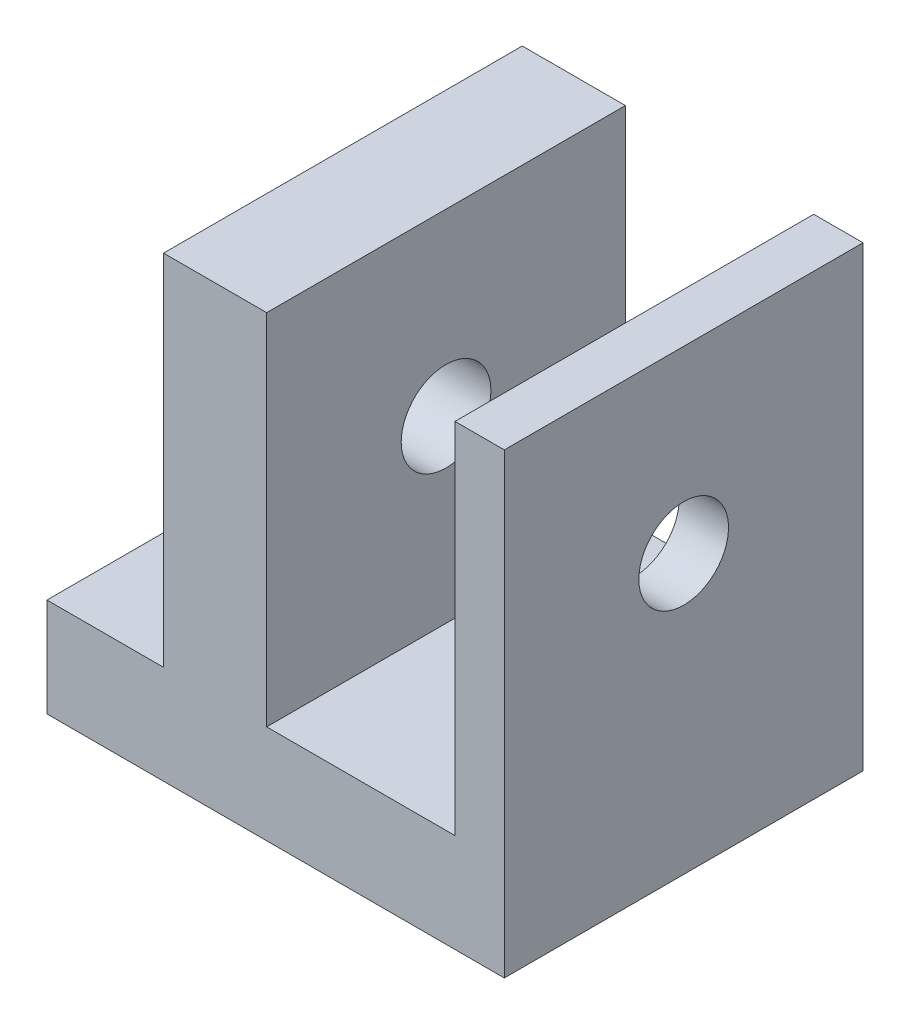
ISO-10303-21;
HEADER;
FILE_DESCRIPTION(('STEP AP214'),'2;1');
FILE_NAME('part.step','',(''),(''),'','','');
FILE_SCHEMA(('AUTOMOTIVE_DESIGN { 1 0 10303 214 1 1 1 1 }'));
ENDSEC;
DATA;
#1=APPLICATION_CONTEXT('core data for automotive mechanical design processes');
#2=APPLICATION_PROTOCOL_DEFINITION('international standard','automotive_design',2000,#1);
#3=PRODUCT_CONTEXT('',#1,'mechanical');
#4=PRODUCT('Part','Part','',(#3));
#5=PRODUCT_RELATED_PRODUCT_CATEGORY('part','',(#4));
#6=PRODUCT_DEFINITION_FORMATION('','',#4);
#7=PRODUCT_DEFINITION_CONTEXT('part definition',#1,'design');
#8=PRODUCT_DEFINITION('design','',#6,#7);
#9=PRODUCT_DEFINITION_SHAPE('','',#8);
#10=(LENGTH_UNIT() NAMED_UNIT(*) SI_UNIT(.MILLI.,.METRE.));
#11=(NAMED_UNIT(*) PLANE_ANGLE_UNIT() SI_UNIT($,.RADIAN.));
#12=(NAMED_UNIT(*) SI_UNIT($,.STERADIAN.) SOLID_ANGLE_UNIT());
#13=UNCERTAINTY_MEASURE_WITH_UNIT(LENGTH_MEASURE(1.E-05),#10,'distance_accuracy_value','');
#14=(GEOMETRIC_REPRESENTATION_CONTEXT(3) GLOBAL_UNCERTAINTY_ASSIGNED_CONTEXT((#13)) GLOBAL_UNIT_ASSIGNED_CONTEXT((#10,
#11,#12)) REPRESENTATION_CONTEXT('',''));
#15=CARTESIAN_POINT('',(0.,0.,0.));
#16=DIRECTION('',(0.,0.,1.));
#17=DIRECTION('',(1.,0.,0.));
#18=AXIS2_PLACEMENT_3D('',#15,#16,#17);
#19=CARTESIAN_POINT('',(0.,0.,-10.));
#20=DIRECTION('',(0.,0.,1.));
#21=DIRECTION('',(1.,0.,0.));
#22=AXIS2_PLACEMENT_3D('',#19,#20,#21);
#23=PLANE('',#22);
#24=DIRECTION('',(-1.,0.,0.));
#25=VECTOR('',#24,1.);
#26=CARTESIAN_POINT('',(0.,24.25,-10.));
#27=LINE('',#26,#25);
#28=CARTESIAN_POINT('',(12.75,24.25,-10.));
#29=VERTEX_POINT('',#28);
#30=CARTESIAN_POINT('',(10.,24.25,-10.));
#31=VERTEX_POINT('',#30);
#32=EDGE_CURVE('E506',#29,#31,#27,.T.);
#33=ORIENTED_EDGE('',*,*,#32,.F.);
#34=DIRECTION('',(0.,1.,0.));
#35=VECTOR('',#34,1.);
#36=CARTESIAN_POINT('',(12.75,0.,-10.));
#37=LINE('',#36,#35);
#38=CARTESIAN_POINT('',(12.75,-1.25,-10.));
#39=VERTEX_POINT('',#38);
#40=EDGE_CURVE('E452',#39,#29,#37,.T.);
#41=ORIENTED_EDGE('',*,*,#40,.F.);
#42=DIRECTION('',(1.,0.,0.));
#43=VECTOR('',#42,1.);
#44=CARTESIAN_POINT('',(0.,-1.25,-10.));
#45=LINE('',#44,#43);
#46=CARTESIAN_POINT('',(-12.75,-1.25,-10.));
#47=VERTEX_POINT('',#46);
#48=EDGE_CURVE('E446',#47,#39,#45,.T.);
#49=ORIENTED_EDGE('',*,*,#48,.F.);
#50=DIRECTION('',(0.,1.,0.));
#51=VECTOR('',#50,1.);
#52=CARTESIAN_POINT('',(-12.75,0.,-10.));
#53=LINE('',#52,#51);
#54=CARTESIAN_POINT('',(-12.75,4.25,-10.));
#55=VERTEX_POINT('',#54);
#56=EDGE_CURVE('E487',#47,#55,#53,.T.);
#57=ORIENTED_EDGE('',*,*,#56,.T.);
#58=DIRECTION('',(1.,0.,0.));
#59=VECTOR('',#58,1.);
#60=CARTESIAN_POINT('',(0.,4.25000000000001,-10.));
#61=LINE('',#60,#59);
#62=CARTESIAN_POINT('',(-6.25,4.25,-10.));
#63=VERTEX_POINT('',#62);
#64=EDGE_CURVE('E525',#55,#63,#61,.T.);
#65=ORIENTED_EDGE('',*,*,#64,.T.);
#66=DIRECTION('',(0.,1.,0.));
#67=VECTOR('',#66,1.);
#68=CARTESIAN_POINT('',(-6.25,0.,-10.));
#69=LINE('',#68,#67);
#70=CARTESIAN_POINT('',(-6.25,24.25,-10.));
#71=VERTEX_POINT('',#70);
#72=EDGE_CURVE('E522',#63,#71,#69,.T.);
#73=ORIENTED_EDGE('',*,*,#72,.T.);
#74=DIRECTION('',(1.,0.,0.));
#75=VECTOR('',#74,1.);
#76=CARTESIAN_POINT('',(0.,24.25,-10.));
#77=LINE('',#76,#75);
#78=CARTESIAN_POINT('',(-0.499999999999999,24.25,-10.));
#79=VERTEX_POINT('',#78);
#80=EDGE_CURVE('E519',#71,#79,#77,.T.);
#81=ORIENTED_EDGE('',*,*,#80,.T.);
#82=DIRECTION('',(0.,-1.,0.));
#83=VECTOR('',#82,1.);
#84=CARTESIAN_POINT('',(-0.499999999999996,0.,-10.));
#85=LINE('',#84,#83);
#86=CARTESIAN_POINT('',(-0.499999999999996,4.25,-10.));
#87=VERTEX_POINT('',#86);
#88=EDGE_CURVE('E516',#79,#87,#85,.T.);
#89=ORIENTED_EDGE('',*,*,#88,.T.);
#90=DIRECTION('',(1.,0.,0.));
#91=VECTOR('',#90,1.);
#92=CARTESIAN_POINT('',(0.,4.25,-10.));
#93=LINE('',#92,#91);
#94=CARTESIAN_POINT('',(10.,4.25,-10.));
#95=VERTEX_POINT('',#94);
#96=EDGE_CURVE('E513',#87,#95,#93,.T.);
#97=ORIENTED_EDGE('',*,*,#96,.T.);
#98=DIRECTION('',(0.,-1.,0.));
#99=VECTOR('',#98,1.);
#100=CARTESIAN_POINT('',(10.,0.,-10.));
#101=LINE('',#100,#99);
#102=EDGE_CURVE('E509',#31,#95,#101,.T.);
#103=ORIENTED_EDGE('',*,*,#102,.F.);
#104=EDGE_LOOP('',(#33,#41,#49,#57,#65,#73,#81,#89,#97,#103));
#105=FACE_BOUND('',#104,.T.);
#106=ADVANCED_FACE('F395',(#105),#23,.F.);
#107=CARTESIAN_POINT('',(10.,0.,10.));
#108=DIRECTION('',(1.,0.,0.));
#109=DIRECTION('',(0.,1.,0.));
#110=AXIS2_PLACEMENT_3D('',#107,#108,#109);
#111=PLANE('',#110);
#112=CARTESIAN_POINT('',(10.,14.25,0.));
#113=DIRECTION('',(1.,0.,0.));
#114=DIRECTION('',(0.,1.,0.));
#115=AXIS2_PLACEMENT_3D('',#112,#113,#114);
#116=CIRCLE('',#115,2.5);
#117=CARTESIAN_POINT('',(10.,16.75,0.));
#118=VERTEX_POINT('',#117);
#119=EDGE_CURVE('E717',#118,#118,#116,.T.);
#120=ORIENTED_EDGE('',*,*,#119,.T.);
#121=EDGE_LOOP('',(#120));
#122=FACE_BOUND('',#121,.T.);
#123=ORIENTED_EDGE('',*,*,#102,.T.);
#124=DIRECTION('',(0.,0.,-1.));
#125=VECTOR('',#124,1.);
#126=CARTESIAN_POINT('',(10.,4.25,10.));
#127=LINE('',#126,#125);
#128=CARTESIAN_POINT('',(10.,4.25,10.));
#129=VERTEX_POINT('',#128);
#130=EDGE_CURVE('E404',#129,#95,#127,.T.);
#131=ORIENTED_EDGE('',*,*,#130,.F.);
#132=DIRECTION('',(0.,-1.,0.));
#133=VECTOR('',#132,1.);
#134=CARTESIAN_POINT('',(10.,0.,10.));
#135=LINE('',#134,#133);
#136=CARTESIAN_POINT('',(10.,24.25,10.));
#137=VERTEX_POINT('',#136);
#138=EDGE_CURVE('E460',#137,#129,#135,.T.);
#139=ORIENTED_EDGE('',*,*,#138,.F.);
#140=DIRECTION('',(0.,0.,-1.));
#141=VECTOR('',#140,1.);
#142=CARTESIAN_POINT('',(10.,24.25,10.));
#143=LINE('',#142,#141);
#144=EDGE_CURVE('E12',#137,#31,#143,.T.);
#145=ORIENTED_EDGE('',*,*,#144,.T.);
#146=EDGE_LOOP('',(#123,#131,#139,#145));
#147=FACE_BOUND('',#146,.T.);
#148=ADVANCED_FACE('F548',(#122,#147),#111,.F.);
#149=CARTESIAN_POINT('',(0.,4.25,10.));
#150=DIRECTION('',(0.,1.,0.));
#151=DIRECTION('',(-1.,0.,0.));
#152=AXIS2_PLACEMENT_3D('',#149,#150,#151);
#153=PLANE('',#152);
#154=ORIENTED_EDGE('',*,*,#96,.F.);
#155=DIRECTION('',(0.,0.,-1.));
#156=VECTOR('',#155,1.);
#157=CARTESIAN_POINT('',(-0.499999999999996,4.25,10.));
#158=LINE('',#157,#156);
#159=CARTESIAN_POINT('',(-0.499999999999996,4.25,10.));
#160=VERTEX_POINT('',#159);
#161=EDGE_CURVE('E541',#160,#87,#158,.T.);
#162=ORIENTED_EDGE('',*,*,#161,.F.);
#163=DIRECTION('',(1.,0.,0.));
#164=VECTOR('',#163,1.);
#165=CARTESIAN_POINT('',(0.,4.25,10.));
#166=LINE('',#165,#164);
#167=EDGE_CURVE('E547',#160,#129,#166,.T.);
#168=ORIENTED_EDGE('',*,*,#167,.T.);
#169=ORIENTED_EDGE('',*,*,#130,.T.);
#170=EDGE_LOOP('',(#154,#162,#168,#169));
#171=FACE_BOUND('',#170,.T.);
#172=ADVANCED_FACE('F545',(#171),#153,.T.);
#173=CARTESIAN_POINT('',(-0.499999999999996,0.,10.));
#174=DIRECTION('',(1.,0.,0.));
#175=DIRECTION('',(0.,1.,0.));
#176=AXIS2_PLACEMENT_3D('',#173,#174,#175);
#177=PLANE('',#176);
#178=CARTESIAN_POINT('',(-0.5,14.25,0.));
#179=DIRECTION('',(1.,0.,0.));
#180=DIRECTION('',(0.,1.,0.));
#181=AXIS2_PLACEMENT_3D('',#178,#179,#180);
#182=CIRCLE('',#181,2.5);
#183=CARTESIAN_POINT('',(-0.500000000000001,16.75,0.));
#184=VERTEX_POINT('',#183);
#185=EDGE_CURVE('E707',#184,#184,#182,.T.);
#186=ORIENTED_EDGE('',*,*,#185,.F.);
#187=EDGE_LOOP('',(#186));
#188=FACE_BOUND('',#187,.T.);
#189=ORIENTED_EDGE('',*,*,#88,.F.);
#190=DIRECTION('',(0.,0.,-1.));
#191=VECTOR('',#190,1.);
#192=CARTESIAN_POINT('',(-0.499999999999999,24.25,10.));
#193=LINE('',#192,#191);
#194=CARTESIAN_POINT('',(-0.499999999999999,24.25,10.));
#195=VERTEX_POINT('',#194);
#196=EDGE_CURVE('E539',#195,#79,#193,.T.);
#197=ORIENTED_EDGE('',*,*,#196,.F.);
#198=DIRECTION('',(0.,-1.,0.));
#199=VECTOR('',#198,1.);
#200=CARTESIAN_POINT('',(-0.499999999999996,0.,10.));
#201=LINE('',#200,#199);
#202=EDGE_CURVE('E558',#195,#160,#201,.T.);
#203=ORIENTED_EDGE('',*,*,#202,.T.);
#204=ORIENTED_EDGE('',*,*,#161,.T.);
#205=EDGE_LOOP('',(#189,#197,#203,#204));
#206=FACE_BOUND('',#205,.T.);
#207=ADVANCED_FACE('F555',(#188,#206),#177,.T.);
#208=CARTESIAN_POINT('',(0.,24.25,10.));
#209=DIRECTION('',(0.,1.,0.));
#210=DIRECTION('',(-1.,0.,0.));
#211=AXIS2_PLACEMENT_3D('',#208,#209,#210);
#212=PLANE('',#211);
#213=ORIENTED_EDGE('',*,*,#80,.F.);
#214=DIRECTION('',(0.,0.,-1.));
#215=VECTOR('',#214,1.);
#216=CARTESIAN_POINT('',(-6.25,24.25,10.));
#217=LINE('',#216,#215);
#218=CARTESIAN_POINT('',(-6.25,24.25,10.));
#219=VERTEX_POINT('',#218);
#220=EDGE_CURVE('E537',#219,#71,#217,.T.);
#221=ORIENTED_EDGE('',*,*,#220,.F.);
#222=DIRECTION('',(1.,0.,0.));
#223=VECTOR('',#222,1.);
#224=CARTESIAN_POINT('',(0.,24.25,10.));
#225=LINE('',#224,#223);
#226=EDGE_CURVE('E562',#219,#195,#225,.T.);
#227=ORIENTED_EDGE('',*,*,#226,.T.);
#228=ORIENTED_EDGE('',*,*,#196,.T.);
#229=EDGE_LOOP('',(#213,#221,#227,#228));
#230=FACE_BOUND('',#229,.T.);
#231=ADVANCED_FACE('F610',(#230),#212,.T.);
#232=CARTESIAN_POINT('',(-6.25,0.,10.));
#233=DIRECTION('',(-1.,0.,0.));
#234=DIRECTION('',(0.,0.,1.));
#235=AXIS2_PLACEMENT_3D('',#232,#233,#234);
#236=PLANE('',#235);
#237=CARTESIAN_POINT('',(-6.25,14.25,0.));
#238=DIRECTION('',(-1.,0.,0.));
#239=DIRECTION('',(0.,0.,1.));
#240=AXIS2_PLACEMENT_3D('',#237,#238,#239);
#241=CIRCLE('',#240,2.5);
#242=CARTESIAN_POINT('',(-6.25,14.25,2.5));
#243=VERTEX_POINT('',#242);
#244=EDGE_CURVE('E710',#243,#243,#241,.T.);
#245=ORIENTED_EDGE('',*,*,#244,.F.);
#246=EDGE_LOOP('',(#245));
#247=FACE_BOUND('',#246,.T.);
#248=ORIENTED_EDGE('',*,*,#72,.F.);
#249=DIRECTION('',(0.,0.,-1.));
#250=VECTOR('',#249,1.);
#251=CARTESIAN_POINT('',(-6.25,4.25,10.));
#252=LINE('',#251,#250);
#253=CARTESIAN_POINT('',(-6.25,4.25,10.));
#254=VERTEX_POINT('',#253);
#255=EDGE_CURVE('E535',#254,#63,#252,.T.);
#256=ORIENTED_EDGE('',*,*,#255,.F.);
#257=DIRECTION('',(0.,1.,0.));
#258=VECTOR('',#257,1.);
#259=CARTESIAN_POINT('',(-6.25,0.,10.));
#260=LINE('',#259,#258);
#261=EDGE_CURVE('E500',#254,#219,#260,.T.);
#262=ORIENTED_EDGE('',*,*,#261,.T.);
#263=ORIENTED_EDGE('',*,*,#220,.T.);
#264=EDGE_LOOP('',(#248,#256,#262,#263));
#265=FACE_BOUND('',#264,.T.);
#266=ADVANCED_FACE('F570',(#247,#265),#236,.T.);
#267=CARTESIAN_POINT('',(0.,4.25000000000001,10.));
#268=DIRECTION('',(0.,1.,0.));
#269=DIRECTION('',(-1.,0.,0.));
#270=AXIS2_PLACEMENT_3D('',#267,#268,#269);
#271=PLANE('',#270);
#272=CARTESIAN_POINT('',(-9.5,4.25,3.));
#273=DIRECTION('',(0.,1.,0.));
#274=DIRECTION('',(-1.,0.,0.));
#275=AXIS2_PLACEMENT_3D('',#272,#273,#274);
#276=CIRCLE('',#275,1.69999999999999);
#277=CARTESIAN_POINT('',(-11.2,4.25,3.));
#278=VERTEX_POINT('',#277);
#279=EDGE_CURVE('E722',#278,#278,#276,.T.);
#280=ORIENTED_EDGE('',*,*,#279,.F.);
#281=EDGE_LOOP('',(#280));
#282=FACE_BOUND('',#281,.T.);
#283=CARTESIAN_POINT('',(-9.5,4.25,-3.));
#284=DIRECTION('',(0.,1.,0.));
#285=DIRECTION('',(-1.,0.,0.));
#286=AXIS2_PLACEMENT_3D('',#283,#284,#285);
#287=CIRCLE('',#286,1.69999999999999);
#288=CARTESIAN_POINT('',(-11.2,4.25,-3.));
#289=VERTEX_POINT('',#288);
#290=EDGE_CURVE('E510',#289,#289,#287,.T.);
#291=ORIENTED_EDGE('',*,*,#290,.F.);
#292=EDGE_LOOP('',(#291));
#293=FACE_BOUND('',#292,.T.);
#294=ORIENTED_EDGE('',*,*,#64,.F.);
#295=DIRECTION('',(0.,0.,-1.));
#296=VECTOR('',#295,1.);
#297=CARTESIAN_POINT('',(-12.75,4.25,10.));
#298=LINE('',#297,#296);
#299=CARTESIAN_POINT('',(-12.75,4.25,10.));
#300=VERTEX_POINT('',#299);
#301=EDGE_CURVE('E488',#300,#55,#298,.T.);
#302=ORIENTED_EDGE('',*,*,#301,.F.);
#303=DIRECTION('',(1.,0.,0.));
#304=VECTOR('',#303,1.);
#305=CARTESIAN_POINT('',(0.,4.25000000000001,10.));
#306=LINE('',#305,#304);
#307=EDGE_CURVE('E498',#300,#254,#306,.T.);
#308=ORIENTED_EDGE('',*,*,#307,.T.);
#309=ORIENTED_EDGE('',*,*,#255,.T.);
#310=EDGE_LOOP('',(#294,#302,#308,#309));
#311=FACE_BOUND('',#310,.T.);
#312=ADVANCED_FACE('F573',(#282,#293,#311),#271,.T.);
#313=CARTESIAN_POINT('',(-12.75,0.,10.));
#314=DIRECTION('',(-1.,0.,0.));
#315=DIRECTION('',(0.,0.,1.));
#316=AXIS2_PLACEMENT_3D('',#313,#314,#315);
#317=PLANE('',#316);
#318=ORIENTED_EDGE('',*,*,#56,.F.);
#319=DIRECTION('',(0.,0.,-1.));
#320=VECTOR('',#319,1.);
#321=CARTESIAN_POINT('',(-12.75,-1.25,10.));
#322=LINE('',#321,#320);
#323=CARTESIAN_POINT('',(-12.75,-1.25,10.));
#324=VERTEX_POINT('',#323);
#325=EDGE_CURVE('E481',#324,#47,#322,.T.);
#326=ORIENTED_EDGE('',*,*,#325,.F.);
#327=DIRECTION('',(0.,1.,0.));
#328=VECTOR('',#327,1.);
#329=CARTESIAN_POINT('',(-12.75,0.,10.));
#330=LINE('',#329,#328);
#331=EDGE_CURVE('E485',#324,#300,#330,.T.);
#332=ORIENTED_EDGE('',*,*,#331,.T.);
#333=ORIENTED_EDGE('',*,*,#301,.T.);
#334=EDGE_LOOP('',(#318,#326,#332,#333));
#335=FACE_BOUND('',#334,.T.);
#336=ADVANCED_FACE('F483',(#335),#317,.T.);
#337=CARTESIAN_POINT('',(0.,-1.25,10.));
#338=DIRECTION('',(0.,1.,0.));
#339=DIRECTION('',(0.,0.,1.));
#340=AXIS2_PLACEMENT_3D('',#337,#338,#339);
#341=PLANE('',#340);
#342=CARTESIAN_POINT('',(-9.5,-1.25,3.));
#343=DIRECTION('',(0.,-1.,0.));
#344=DIRECTION('',(0.,0.,-1.));
#345=AXIS2_PLACEMENT_3D('',#342,#343,#344);
#346=CIRCLE('',#345,1.69999999999999);
#347=CARTESIAN_POINT('',(-9.5,-1.25,1.30000000000001));
#348=VERTEX_POINT('',#347);
#349=EDGE_CURVE('E719',#348,#348,#346,.T.);
#350=ORIENTED_EDGE('',*,*,#349,.F.);
#351=EDGE_LOOP('',(#350));
#352=FACE_BOUND('',#351,.T.);
#353=CARTESIAN_POINT('',(-9.5,-1.25,-3.));
#354=DIRECTION('',(0.,-1.,0.));
#355=DIRECTION('',(0.,0.,-1.));
#356=AXIS2_PLACEMENT_3D('',#353,#354,#355);
#357=CIRCLE('',#356,1.69999999999999);
#358=CARTESIAN_POINT('',(-9.5,-1.25,-4.69999999999999));
#359=VERTEX_POINT('',#358);
#360=EDGE_CURVE('E725',#359,#359,#357,.T.);
#361=ORIENTED_EDGE('',*,*,#360,.F.);
#362=EDGE_LOOP('',(#361));
#363=FACE_BOUND('',#362,.T.);
#364=ORIENTED_EDGE('',*,*,#48,.T.);
#365=DIRECTION('',(0.,0.,-1.));
#366=VECTOR('',#365,1.);
#367=CARTESIAN_POINT('',(12.75,-1.25,10.));
#368=LINE('',#367,#366);
#369=CARTESIAN_POINT('',(12.75,-1.25,10.));
#370=VERTEX_POINT('',#369);
#371=EDGE_CURVE('E489',#370,#39,#368,.T.);
#372=ORIENTED_EDGE('',*,*,#371,.F.);
#373=DIRECTION('',(1.,0.,0.));
#374=VECTOR('',#373,1.);
#375=CARTESIAN_POINT('',(0.,-1.25,10.));
#376=LINE('',#375,#374);
#377=EDGE_CURVE('E491',#324,#370,#376,.T.);
#378=ORIENTED_EDGE('',*,*,#377,.F.);
#379=ORIENTED_EDGE('',*,*,#325,.T.);
#380=EDGE_LOOP('',(#364,#372,#378,#379));
#381=FACE_BOUND('',#380,.T.);
#382=ADVANCED_FACE('F492',(#352,#363,#381),#341,.F.);
#383=CARTESIAN_POINT('',(12.75,0.,10.));
#384=DIRECTION('',(-1.,0.,0.));
#385=DIRECTION('',(0.,0.,1.));
#386=AXIS2_PLACEMENT_3D('',#383,#384,#385);
#387=PLANE('',#386);
#388=CARTESIAN_POINT('',(12.75,14.25,0.));
#389=DIRECTION('',(-1.,0.,0.));
#390=DIRECTION('',(0.,0.,1.));
#391=AXIS2_PLACEMENT_3D('',#388,#389,#390);
#392=CIRCLE('',#391,2.5);
#393=CARTESIAN_POINT('',(12.75,14.25,2.5));
#394=VERTEX_POINT('',#393);
#395=EDGE_CURVE('E711',#394,#394,#392,.F.);
#396=ORIENTED_EDGE('',*,*,#395,.F.);
#397=EDGE_LOOP('',(#396));
#398=FACE_BOUND('',#397,.T.);
#399=ORIENTED_EDGE('',*,*,#40,.T.);
#400=DIRECTION('',(0.,0.,-1.));
#401=VECTOR('',#400,1.);
#402=CARTESIAN_POINT('',(12.75,24.25,10.));
#403=LINE('',#402,#401);
#404=CARTESIAN_POINT('',(12.75,24.25,10.));
#405=VERTEX_POINT('',#404);
#406=EDGE_CURVE('E505',#405,#29,#403,.T.);
#407=ORIENTED_EDGE('',*,*,#406,.F.);
#408=DIRECTION('',(0.,1.,0.));
#409=VECTOR('',#408,1.);
#410=CARTESIAN_POINT('',(12.75,0.,10.));
#411=LINE('',#410,#409);
#412=EDGE_CURVE('E412',#370,#405,#411,.T.);
#413=ORIENTED_EDGE('',*,*,#412,.F.);
#414=ORIENTED_EDGE('',*,*,#371,.T.);
#415=EDGE_LOOP('',(#399,#407,#413,#414));
#416=FACE_BOUND('',#415,.T.);
#417=ADVANCED_FACE('F576',(#398,#416),#387,.F.);
#418=CARTESIAN_POINT('',(0.,24.25,10.));
#419=DIRECTION('',(0.,-1.,0.));
#420=DIRECTION('',(0.,0.,-1.));
#421=AXIS2_PLACEMENT_3D('',#418,#419,#420);
#422=PLANE('',#421);
#423=ORIENTED_EDGE('',*,*,#32,.T.);
#424=ORIENTED_EDGE('',*,*,#144,.F.);
#425=DIRECTION('',(-1.,0.,0.));
#426=VECTOR('',#425,1.);
#427=CARTESIAN_POINT('',(0.,24.25,10.));
#428=LINE('',#427,#426);
#429=EDGE_CURVE('E531',#405,#137,#428,.T.);
#430=ORIENTED_EDGE('',*,*,#429,.F.);
#431=ORIENTED_EDGE('',*,*,#406,.T.);
#432=EDGE_LOOP('',(#423,#424,#430,#431));
#433=FACE_BOUND('',#432,.T.);
#434=ADVANCED_FACE('F397',(#433),#422,.F.);
#435=CARTESIAN_POINT('',(0.,0.,10.));
#436=DIRECTION('',(0.,0.,1.));
#437=DIRECTION('',(1.,0.,0.));
#438=AXIS2_PLACEMENT_3D('',#435,#436,#437);
#439=PLANE('',#438);
#440=ORIENTED_EDGE('',*,*,#429,.T.);
#441=ORIENTED_EDGE('',*,*,#138,.T.);
#442=ORIENTED_EDGE('',*,*,#167,.F.);
#443=ORIENTED_EDGE('',*,*,#202,.F.);
#444=ORIENTED_EDGE('',*,*,#226,.F.);
#445=ORIENTED_EDGE('',*,*,#261,.F.);
#446=ORIENTED_EDGE('',*,*,#307,.F.);
#447=ORIENTED_EDGE('',*,*,#331,.F.);
#448=ORIENTED_EDGE('',*,*,#377,.T.);
#449=ORIENTED_EDGE('',*,*,#412,.T.);
#450=EDGE_LOOP('',(#440,#441,#442,#443,#444,#445,#446,#447,#448,#449));
#451=FACE_BOUND('',#450,.T.);
#452=ADVANCED_FACE('F495',(#451),#439,.T.);
#453=CARTESIAN_POINT('',(-9.5,-1.25,-3.));
#454=DIRECTION('',(0.,-1.,0.));
#455=DIRECTION('',(0.,0.,-1.));
#456=AXIS2_PLACEMENT_3D('',#453,#454,#455);
#457=CYLINDRICAL_SURFACE('',#456,1.69999999999999);
#458=ORIENTED_EDGE('',*,*,#290,.T.);
#459=EDGE_LOOP('',(#458));
#460=FACE_BOUND('',#459,.T.);
#461=ORIENTED_EDGE('',*,*,#360,.T.);
#462=EDGE_LOOP('',(#461));
#463=FACE_BOUND('',#462,.T.);
#464=ADVANCED_FACE('F584',(#460,#463),#457,.F.);
#465=CARTESIAN_POINT('',(-9.5,-1.25,3.));
#466=DIRECTION('',(0.,-1.,0.));
#467=DIRECTION('',(0.,0.,-1.));
#468=AXIS2_PLACEMENT_3D('',#465,#466,#467);
#469=CYLINDRICAL_SURFACE('',#468,1.69999999999999);
#470=ORIENTED_EDGE('',*,*,#279,.T.);
#471=EDGE_LOOP('',(#470));
#472=FACE_BOUND('',#471,.T.);
#473=ORIENTED_EDGE('',*,*,#349,.T.);
#474=EDGE_LOOP('',(#473));
#475=FACE_BOUND('',#474,.T.);
#476=ADVANCED_FACE('F594',(#472,#475),#469,.F.);
#477=CARTESIAN_POINT('',(19.8210678118655,14.25,0.));
#478=DIRECTION('',(-1.,0.,0.));
#479=DIRECTION('',(0.,0.,1.));
#480=AXIS2_PLACEMENT_3D('',#477,#478,#479);
#481=CYLINDRICAL_SURFACE('',#480,2.5);
#482=ORIENTED_EDGE('',*,*,#395,.T.);
#483=EDGE_LOOP('',(#482));
#484=FACE_BOUND('',#483,.T.);
#485=ORIENTED_EDGE('',*,*,#119,.F.);
#486=EDGE_LOOP('',(#485));
#487=FACE_BOUND('',#486,.T.);
#488=ADVANCED_FACE('F653',(#484,#487),#481,.F.);
#489=ORIENTED_EDGE('',*,*,#185,.T.);
#490=EDGE_LOOP('',(#489));
#491=FACE_BOUND('',#490,.T.);
#492=ORIENTED_EDGE('',*,*,#244,.T.);
#493=EDGE_LOOP('',(#492));
#494=FACE_BOUND('',#493,.T.);
#495=ADVANCED_FACE('F691',(#491,#494),#481,.F.);
#496=CLOSED_SHELL('',(#106,#148,#172,#207,#231,#266,#312,#336,#382,#417,#434,#452,#464,#476,
#488,#495));
#497=MANIFOLD_SOLID_BREP('B2',#496);
#498=ADVANCED_BREP_SHAPE_REPRESENTATION('',(#18,#497),#14);
#499=SHAPE_DEFINITION_REPRESENTATION(#9,#498);
ENDSEC;
END-ISO-10303-21;
